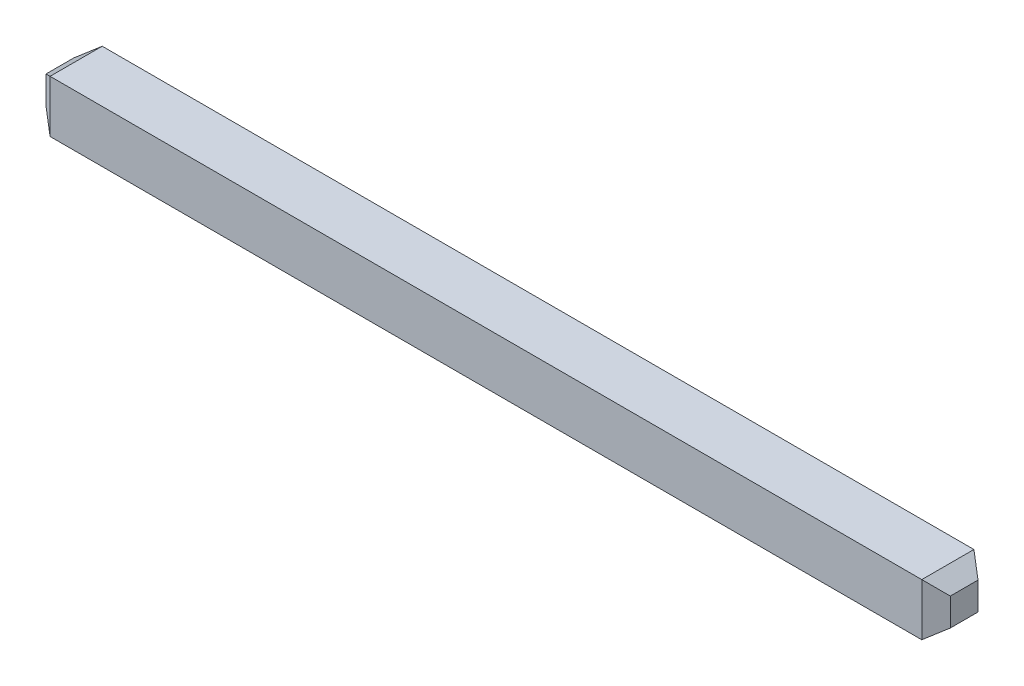
ISO-10303-21;
HEADER;
FILE_DESCRIPTION(('STEP AP214'),'2;1');
FILE_NAME('part.step','',(''),(''),'','','');
FILE_SCHEMA(('AUTOMOTIVE_DESIGN { 1 0 10303 214 1 1 1 1 }'));
ENDSEC;
DATA;
#1=APPLICATION_CONTEXT('core data for automotive mechanical design processes');
#2=APPLICATION_PROTOCOL_DEFINITION('international standard','automotive_design',2000,#1);
#3=PRODUCT_CONTEXT('',#1,'mechanical');
#4=PRODUCT('Part','Part','',(#3));
#5=PRODUCT_RELATED_PRODUCT_CATEGORY('part','',(#4));
#6=PRODUCT_DEFINITION_FORMATION('','',#4);
#7=PRODUCT_DEFINITION_CONTEXT('part definition',#1,'design');
#8=PRODUCT_DEFINITION('design','',#6,#7);
#9=PRODUCT_DEFINITION_SHAPE('','',#8);
#10=(LENGTH_UNIT() NAMED_UNIT(*) SI_UNIT(.MILLI.,.METRE.));
#11=(NAMED_UNIT(*) PLANE_ANGLE_UNIT() SI_UNIT($,.RADIAN.));
#12=(NAMED_UNIT(*) SI_UNIT($,.STERADIAN.) SOLID_ANGLE_UNIT());
#13=UNCERTAINTY_MEASURE_WITH_UNIT(LENGTH_MEASURE(1.E-05),#10,'distance_accuracy_value','');
#14=(GEOMETRIC_REPRESENTATION_CONTEXT(3) GLOBAL_UNCERTAINTY_ASSIGNED_CONTEXT((#13)) GLOBAL_UNIT_ASSIGNED_CONTEXT((#10,
#11,#12)) REPRESENTATION_CONTEXT('',''));
#15=CARTESIAN_POINT('',(0.,0.,0.));
#16=DIRECTION('',(0.,0.,1.));
#17=DIRECTION('',(1.,0.,0.));
#18=AXIS2_PLACEMENT_3D('',#15,#16,#17);
#19=CARTESIAN_POINT('',(-2.4,1.23,-31.995));
#20=DIRECTION('',(0.599999999990736,0.,0.800000000006948));
#21=DIRECTION('',(0.800000000006948,0.,-0.599999999990736));
#22=AXIS2_PLACEMENT_3D('',#19,#20,#21);
#23=PLANE('',#22);
#24=DIRECTION('',(0.,1.,0.));
#25=VECTOR('',#24,1.);
#26=CARTESIAN_POINT('',(-2.3,1.23,-32.07));
#27=LINE('',#26,#25);
#28=CARTESIAN_POINT('',(-2.29999999999957,1.55,-32.0699999999994));
#29=VERTEX_POINT('',#28);
#30=CARTESIAN_POINT('',(-2.29999999999958,0.909999999999898,-32.0699999999994));
#31=VERTEX_POINT('',#30);
#32=EDGE_CURVE('E101',#29,#31,#27,.F.);
#33=ORIENTED_EDGE('',*,*,#32,.T.);
#34=DIRECTION('',(-0.685994340569495,0.514495755428344,0.514495755427429));
#35=VECTOR('',#34,1.);
#36=CARTESIAN_POINT('',(-2.30000000000009,0.909999999999786,-32.07));
#37=LINE('',#36,#35);
#38=CARTESIAN_POINT('',(-2.50000000000021,1.06000000000001,-31.9200000000003));
#39=VERTEX_POINT('',#38);
#40=EDGE_CURVE('E85',#31,#39,#37,.T.);
#41=ORIENTED_EDGE('',*,*,#40,.T.);
#42=DIRECTION('',(0.,1.,0.));
#43=VECTOR('',#42,1.);
#44=CARTESIAN_POINT('',(-2.5,1.23,-31.92));
#45=LINE('',#44,#43);
#46=CARTESIAN_POINT('',(-2.50000000000043,1.4,-31.9200000000006));
#47=VERTEX_POINT('',#46);
#48=EDGE_CURVE('E79',#39,#47,#45,.T.);
#49=ORIENTED_EDGE('',*,*,#48,.T.);
#50=DIRECTION('',(-0.685994340570038,-0.514495755427529,0.51449575542752));
#51=VECTOR('',#50,1.);
#52=CARTESIAN_POINT('',(-2.3,1.55,-32.07));
#53=LINE('',#52,#51);
#54=EDGE_CURVE('E20',#29,#47,#53,.T.);
#55=ORIENTED_EDGE('',*,*,#54,.F.);
#56=EDGE_LOOP('',(#33,#41,#49,#55));
#57=FACE_BOUND('',#56,.T.);
#58=ADVANCED_FACE('F17',(#57),#23,.F.);
#59=CARTESIAN_POINT('',(8.5,1.23,-31.995));
#60=DIRECTION('',(-0.599999999990736,0.,0.800000000006948));
#61=DIRECTION('',(0.800000000006948,0.,0.599999999990736));
#62=AXIS2_PLACEMENT_3D('',#59,#60,#61);
#63=PLANE('',#62);
#64=DIRECTION('',(0.,1.,0.));
#65=VECTOR('',#64,1.);
#66=CARTESIAN_POINT('',(8.6,1.23,-31.92));
#67=LINE('',#66,#65);
#68=CARTESIAN_POINT('',(8.6000000000002,1.06000000000003,-31.9200000000003));
#69=VERTEX_POINT('',#68);
#70=CARTESIAN_POINT('',(8.60000000000043,1.4,-31.9200000000006));
#71=VERTEX_POINT('',#70);
#72=EDGE_CURVE('E113',#69,#71,#67,.T.);
#73=ORIENTED_EDGE('',*,*,#72,.F.);
#74=DIRECTION('',(-0.685994340569496,-0.514495755428343,-0.514495755427429));
#75=VECTOR('',#74,1.);
#76=CARTESIAN_POINT('',(8.59999999999996,1.06000000000005,-31.92));
#77=LINE('',#76,#75);
#78=CARTESIAN_POINT('',(8.39999999999959,0.909999999999884,-32.0699999999994));
#79=VERTEX_POINT('',#78);
#80=EDGE_CURVE('E108',#69,#79,#77,.T.);
#81=ORIENTED_EDGE('',*,*,#80,.T.);
#82=DIRECTION('',(0.,1.,0.));
#83=VECTOR('',#82,1.);
#84=CARTESIAN_POINT('',(8.4,1.23,-32.07));
#85=LINE('',#84,#83);
#86=CARTESIAN_POINT('',(8.39999999999957,1.55,-32.0699999999994));
#87=VERTEX_POINT('',#86);
#88=EDGE_CURVE('E99',#79,#87,#85,.T.);
#89=ORIENTED_EDGE('',*,*,#88,.T.);
#90=DIRECTION('',(-0.685994340570037,0.514495755427528,-0.514495755427522));
#91=VECTOR('',#90,1.);
#92=CARTESIAN_POINT('',(8.6,1.4,-31.92));
#93=LINE('',#92,#91);
#94=EDGE_CURVE('E116',#71,#87,#93,.T.);
#95=ORIENTED_EDGE('',*,*,#94,.F.);
#96=EDGE_LOOP('',(#73,#81,#89,#95));
#97=FACE_BOUND('',#96,.T.);
#98=ADVANCED_FACE('F214',(#97),#63,.F.);
#99=CARTESIAN_POINT('',(-2.4,1.475,-31.75));
#100=DIRECTION('',(-0.6,0.8,0.));
#101=DIRECTION('',(-0.8,-0.6,0.));
#102=AXIS2_PLACEMENT_3D('',#99,#100,#101);
#103=PLANE('',#102);
#104=DIRECTION('',(-0.685994340575952,-0.514495755427538,-0.514495755419626));
#105=VECTOR('',#104,1.);
#106=CARTESIAN_POINT('',(-2.29999999999914,1.55,-31.4300000000012));
#107=LINE('',#106,#105);
#108=CARTESIAN_POINT('',(-2.29999999999989,1.55,-31.4300000000001));
#109=VERTEX_POINT('',#108);
#110=CARTESIAN_POINT('',(-2.50000000000021,1.4,-31.5799999999997));
#111=VERTEX_POINT('',#110);
#112=EDGE_CURVE('E128',#109,#111,#107,.T.);
#113=ORIENTED_EDGE('',*,*,#112,.F.);
#114=DIRECTION('',(0.,0.,1.));
#115=VECTOR('',#114,1.);
#116=CARTESIAN_POINT('',(-2.3,1.55,-31.75));
#117=LINE('',#116,#115);
#118=EDGE_CURVE('E93',#29,#109,#117,.T.);
#119=ORIENTED_EDGE('',*,*,#118,.F.);
#120=ORIENTED_EDGE('',*,*,#54,.T.);
#121=DIRECTION('',(0.,0.,-1.));
#122=VECTOR('',#121,1.);
#123=CARTESIAN_POINT('',(-2.5,1.4,-31.75));
#124=LINE('',#123,#122);
#125=EDGE_CURVE('E87',#47,#111,#124,.F.);
#126=ORIENTED_EDGE('',*,*,#125,.T.);
#127=EDGE_LOOP('',(#113,#119,#120,#126));
#128=FACE_BOUND('',#127,.T.);
#129=ADVANCED_FACE('F90',(#128),#103,.T.);
#130=CARTESIAN_POINT('',(-2.5,1.23,-31.75));
#131=DIRECTION('',(1.,0.,0.));
#132=DIRECTION('',(0.,0.,-1.));
#133=AXIS2_PLACEMENT_3D('',#130,#131,#132);
#134=PLANE('',#133);
#135=DIRECTION('',(0.,1.,0.));
#136=VECTOR('',#135,1.);
#137=CARTESIAN_POINT('',(-2.50000000000086,1.23,-31.5799999999988));
#138=LINE('',#137,#136);
#139=CARTESIAN_POINT('',(-2.50000000000021,1.06000000000001,-31.5799999999997));
#140=VERTEX_POINT('',#139);
#141=EDGE_CURVE('E97',#111,#140,#138,.F.);
#142=ORIENTED_EDGE('',*,*,#141,.F.);
#143=ORIENTED_EDGE('',*,*,#125,.F.);
#144=ORIENTED_EDGE('',*,*,#48,.F.);
#145=DIRECTION('',(0.,0.,1.));
#146=VECTOR('',#145,1.);
#147=CARTESIAN_POINT('',(-2.49999999999996,1.06000000000005,-31.75));
#148=LINE('',#147,#146);
#149=EDGE_CURVE('E105',#39,#140,#148,.T.);
#150=ORIENTED_EDGE('',*,*,#149,.T.);
#151=EDGE_LOOP('',(#142,#143,#144,#150));
#152=FACE_BOUND('',#151,.T.);
#153=ADVANCED_FACE('F95',(#152),#134,.F.);
#154=CARTESIAN_POINT('',(3.05,1.23,-32.07));
#155=DIRECTION('',(0.,0.,1.));
#156=DIRECTION('',(1.,0.,0.));
#157=AXIS2_PLACEMENT_3D('',#154,#155,#156);
#158=PLANE('',#157);
#159=ORIENTED_EDGE('',*,*,#32,.F.);
#160=DIRECTION('',(1.,0.,0.));
#161=VECTOR('',#160,1.);
#162=CARTESIAN_POINT('',(3.05,1.55,-32.07));
#163=LINE('',#162,#161);
#164=EDGE_CURVE('E122',#87,#29,#163,.F.);
#165=ORIENTED_EDGE('',*,*,#164,.F.);
#166=ORIENTED_EDGE('',*,*,#88,.F.);
#167=DIRECTION('',(1.,0.,0.));
#168=VECTOR('',#167,1.);
#169=CARTESIAN_POINT('',(3.05,0.91,-32.07));
#170=LINE('',#169,#168);
#171=EDGE_CURVE('E136',#79,#31,#170,.F.);
#172=ORIENTED_EDGE('',*,*,#171,.T.);
#173=EDGE_LOOP('',(#159,#165,#166,#172));
#174=FACE_BOUND('',#173,.T.);
#175=ADVANCED_FACE('F182',(#174),#158,.F.);
#176=CARTESIAN_POINT('',(-2.4,0.9849999999999,-31.75));
#177=DIRECTION('',(0.600000000000912,0.799999999999316,0.));
#178=DIRECTION('',(-0.799999999999316,0.600000000000912,0.));
#179=AXIS2_PLACEMENT_3D('',#176,#177,#178);
#180=PLANE('',#179);
#181=DIRECTION('',(0.,0.,1.));
#182=VECTOR('',#181,1.);
#183=CARTESIAN_POINT('',(-2.3,0.91,-31.75));
#184=LINE('',#183,#182);
#185=CARTESIAN_POINT('',(-2.29999999999983,0.909999999999856,-31.4300000000003));
#186=VERTEX_POINT('',#185);
#187=EDGE_CURVE('E139',#31,#186,#184,.T.);
#188=ORIENTED_EDGE('',*,*,#187,.T.);
#189=DIRECTION('',(0.685994340575831,-0.51449575542779,0.514495755419536));
#190=VECTOR('',#189,1.);
#191=CARTESIAN_POINT('',(-2.50000000000086,1.06,-31.5799999999988));
#192=LINE('',#191,#190);
#193=EDGE_CURVE('E131',#140,#186,#192,.T.);
#194=ORIENTED_EDGE('',*,*,#193,.F.);
#195=ORIENTED_EDGE('',*,*,#149,.F.);
#196=ORIENTED_EDGE('',*,*,#40,.F.);
#197=EDGE_LOOP('',(#188,#194,#195,#196));
#198=FACE_BOUND('',#197,.T.);
#199=ADVANCED_FACE('F179',(#198),#180,.F.);
#200=CARTESIAN_POINT('',(8.5,0.9849999999999,-31.75));
#201=DIRECTION('',(-0.600000000000912,0.799999999999316,0.));
#202=DIRECTION('',(-0.799999999999316,-0.600000000000912,0.));
#203=AXIS2_PLACEMENT_3D('',#200,#201,#202);
#204=PLANE('',#203);
#205=DIRECTION('',(0.,0.,-1.));
#206=VECTOR('',#205,1.);
#207=CARTESIAN_POINT('',(8.6,1.06,-31.75));
#208=LINE('',#207,#206);
#209=CARTESIAN_POINT('',(8.6000000000002,1.06000000000003,-31.5799999999997));
#210=VERTEX_POINT('',#209);
#211=EDGE_CURVE('E110',#210,#69,#208,.T.);
#212=ORIENTED_EDGE('',*,*,#211,.F.);
#213=DIRECTION('',(0.685994340575829,0.514495755427791,-0.514495755419537));
#214=VECTOR('',#213,1.);
#215=CARTESIAN_POINT('',(8.39999999999914,0.9099999999999,-31.4300000000012));
#216=LINE('',#215,#214);
#217=CARTESIAN_POINT('',(8.39999999999993,0.909999999999868,-31.4300000000001));
#218=VERTEX_POINT('',#217);
#219=EDGE_CURVE('E35',#218,#210,#216,.T.);
#220=ORIENTED_EDGE('',*,*,#219,.F.);
#221=DIRECTION('',(0.,0.,1.));
#222=VECTOR('',#221,1.);
#223=CARTESIAN_POINT('',(8.4,0.91,-31.75));
#224=LINE('',#223,#222);
#225=EDGE_CURVE('E134',#218,#79,#224,.F.);
#226=ORIENTED_EDGE('',*,*,#225,.T.);
#227=ORIENTED_EDGE('',*,*,#80,.F.);
#228=EDGE_LOOP('',(#212,#220,#226,#227));
#229=FACE_BOUND('',#228,.T.);
#230=ADVANCED_FACE('F181',(#229),#204,.F.);
#231=CARTESIAN_POINT('',(8.6,1.23,-31.75));
#232=DIRECTION('',(1.,0.,0.));
#233=DIRECTION('',(0.,0.,-1.));
#234=AXIS2_PLACEMENT_3D('',#231,#232,#233);
#235=PLANE('',#234);
#236=ORIENTED_EDGE('',*,*,#72,.T.);
#237=DIRECTION('',(0.,0.,1.));
#238=VECTOR('',#237,1.);
#239=CARTESIAN_POINT('',(8.6,1.4,-31.75));
#240=LINE('',#239,#238);
#241=CARTESIAN_POINT('',(8.60000000000021,1.4,-31.5799999999997));
#242=VERTEX_POINT('',#241);
#243=EDGE_CURVE('E119',#242,#71,#240,.F.);
#244=ORIENTED_EDGE('',*,*,#243,.F.);
#245=DIRECTION('',(0.,1.,0.));
#246=VECTOR('',#245,1.);
#247=CARTESIAN_POINT('',(8.60000000000086,1.23,-31.5799999999988));
#248=LINE('',#247,#246);
#249=EDGE_CURVE('E142',#210,#242,#248,.T.);
#250=ORIENTED_EDGE('',*,*,#249,.F.);
#251=ORIENTED_EDGE('',*,*,#211,.T.);
#252=EDGE_LOOP('',(#236,#244,#250,#251));
#253=FACE_BOUND('',#252,.T.);
#254=ADVANCED_FACE('F189',(#253),#235,.T.);
#255=CARTESIAN_POINT('',(8.5,1.475,-31.75));
#256=DIRECTION('',(0.6,0.8,0.));
#257=DIRECTION('',(-0.8,0.6,0.));
#258=AXIS2_PLACEMENT_3D('',#255,#256,#257);
#259=PLANE('',#258);
#260=DIRECTION('',(-0.68599434057595,0.514495755427539,0.514495755419628));
#261=VECTOR('',#260,1.);
#262=CARTESIAN_POINT('',(8.60000000000086,1.4,-31.5799999999988));
#263=LINE('',#262,#261);
#264=CARTESIAN_POINT('',(8.39999999999989,1.55,-31.4300000000001));
#265=VERTEX_POINT('',#264);
#266=EDGE_CURVE('E145',#242,#265,#263,.T.);
#267=ORIENTED_EDGE('',*,*,#266,.F.);
#268=ORIENTED_EDGE('',*,*,#243,.T.);
#269=ORIENTED_EDGE('',*,*,#94,.T.);
#270=DIRECTION('',(0.,0.,1.));
#271=VECTOR('',#270,1.);
#272=CARTESIAN_POINT('',(8.4,1.55,-31.75));
#273=LINE('',#272,#271);
#274=EDGE_CURVE('E125',#265,#87,#273,.F.);
#275=ORIENTED_EDGE('',*,*,#274,.F.);
#276=EDGE_LOOP('',(#267,#268,#269,#275));
#277=FACE_BOUND('',#276,.T.);
#278=ADVANCED_FACE('F170',(#277),#259,.T.);
#279=CARTESIAN_POINT('',(3.05,1.55,-31.75));
#280=DIRECTION('',(0.,1.,0.));
#281=DIRECTION('',(0.,0.,1.));
#282=AXIS2_PLACEMENT_3D('',#279,#280,#281);
#283=PLANE('',#282);
#284=DIRECTION('',(1.,0.,0.));
#285=VECTOR('',#284,1.);
#286=CARTESIAN_POINT('',(3.05,1.55,-31.43));
#287=LINE('',#286,#285);
#288=EDGE_CURVE('E148',#265,#109,#287,.F.);
#289=ORIENTED_EDGE('',*,*,#288,.F.);
#290=ORIENTED_EDGE('',*,*,#274,.T.);
#291=ORIENTED_EDGE('',*,*,#164,.T.);
#292=ORIENTED_EDGE('',*,*,#118,.T.);
#293=EDGE_LOOP('',(#289,#290,#291,#292));
#294=FACE_BOUND('',#293,.T.);
#295=ADVANCED_FACE('F173',(#294),#283,.T.);
#296=CARTESIAN_POINT('',(-2.4,1.23,-31.505));
#297=DIRECTION('',(-0.5999999999908,0.,0.8000000000069));
#298=DIRECTION('',(0.8000000000069,0.,0.5999999999908));
#299=AXIS2_PLACEMENT_3D('',#296,#297,#298);
#300=PLANE('',#299);
#301=ORIENTED_EDGE('',*,*,#193,.T.);
#302=DIRECTION('',(0.,1.,0.));
#303=VECTOR('',#302,1.);
#304=CARTESIAN_POINT('',(-2.3,1.23,-31.43));
#305=LINE('',#304,#303);
#306=EDGE_CURVE('E151',#109,#186,#305,.F.);
#307=ORIENTED_EDGE('',*,*,#306,.F.);
#308=ORIENTED_EDGE('',*,*,#112,.T.);
#309=ORIENTED_EDGE('',*,*,#141,.T.);
#310=EDGE_LOOP('',(#301,#307,#308,#309));
#311=FACE_BOUND('',#310,.T.);
#312=ADVANCED_FACE('F176',(#311),#300,.T.);
#313=CARTESIAN_POINT('',(3.05,0.91,-31.75));
#314=DIRECTION('',(0.,1.,0.));
#315=DIRECTION('',(0.,0.,1.));
#316=AXIS2_PLACEMENT_3D('',#313,#314,#315);
#317=PLANE('',#316);
#318=ORIENTED_EDGE('',*,*,#187,.F.);
#319=ORIENTED_EDGE('',*,*,#171,.F.);
#320=ORIENTED_EDGE('',*,*,#225,.F.);
#321=DIRECTION('',(1.,0.,0.));
#322=VECTOR('',#321,1.);
#323=CARTESIAN_POINT('',(3.05,0.9099999999999,-31.43));
#324=LINE('',#323,#322);
#325=EDGE_CURVE('E26',#186,#218,#324,.T.);
#326=ORIENTED_EDGE('',*,*,#325,.F.);
#327=EDGE_LOOP('',(#318,#319,#320,#326));
#328=FACE_BOUND('',#327,.T.);
#329=ADVANCED_FACE('F162',(#328),#317,.F.);
#330=CARTESIAN_POINT('',(8.5,1.23,-31.505));
#331=DIRECTION('',(0.5999999999908,0.,0.8000000000069));
#332=DIRECTION('',(0.8000000000069,0.,-0.5999999999908));
#333=AXIS2_PLACEMENT_3D('',#330,#331,#332);
#334=PLANE('',#333);
#335=ORIENTED_EDGE('',*,*,#266,.T.);
#336=DIRECTION('',(0.,1.,0.));
#337=VECTOR('',#336,1.);
#338=CARTESIAN_POINT('',(8.4,1.23,-31.43));
#339=LINE('',#338,#337);
#340=EDGE_CURVE('E11',#218,#265,#339,.T.);
#341=ORIENTED_EDGE('',*,*,#340,.F.);
#342=ORIENTED_EDGE('',*,*,#219,.T.);
#343=ORIENTED_EDGE('',*,*,#249,.T.);
#344=EDGE_LOOP('',(#335,#341,#342,#343));
#345=FACE_BOUND('',#344,.T.);
#346=ADVANCED_FACE('F166',(#345),#334,.T.);
#347=CARTESIAN_POINT('',(3.05,1.23,-31.43));
#348=DIRECTION('',(0.,0.,1.));
#349=DIRECTION('',(1.,0.,0.));
#350=AXIS2_PLACEMENT_3D('',#347,#348,#349);
#351=PLANE('',#350);
#352=ORIENTED_EDGE('',*,*,#325,.T.);
#353=ORIENTED_EDGE('',*,*,#340,.T.);
#354=ORIENTED_EDGE('',*,*,#288,.T.);
#355=ORIENTED_EDGE('',*,*,#306,.T.);
#356=EDGE_LOOP('',(#352,#353,#354,#355));
#357=FACE_BOUND('',#356,.T.);
#358=ADVANCED_FACE('F157',(#357),#351,.T.);
#359=CLOSED_SHELL('',(#58,#98,#129,#153,#175,#199,#230,#254,#278,#295,#312,#329,#346,#358));
#360=MANIFOLD_SOLID_BREP('B1',#359);
#361=ADVANCED_BREP_SHAPE_REPRESENTATION('',(#18,#360),#14);
#362=SHAPE_DEFINITION_REPRESENTATION(#9,#361);
ENDSEC;
END-ISO-10303-21;
